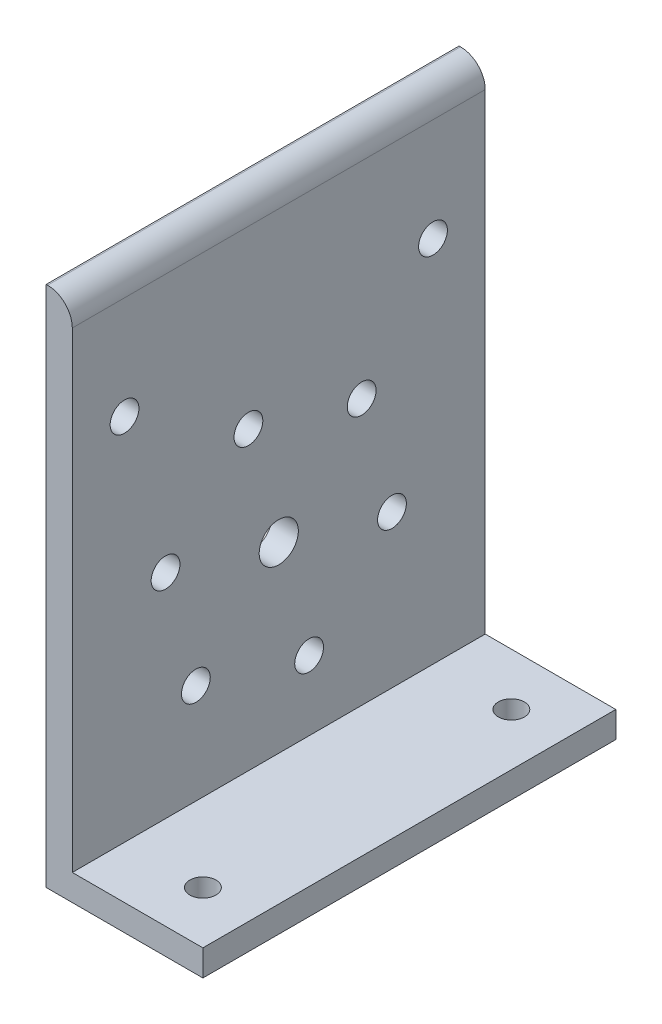
ISO-10303-21;
HEADER;
FILE_DESCRIPTION(('STEP AP214'),'2;1');
FILE_NAME('part.step','',(''),(''),'','','');
FILE_SCHEMA(('AUTOMOTIVE_DESIGN { 1 0 10303 214 1 1 1 1 }'));
ENDSEC;
DATA;
#1=APPLICATION_CONTEXT('core data for automotive mechanical design processes');
#2=APPLICATION_PROTOCOL_DEFINITION('international standard','automotive_design',2000,#1);
#3=PRODUCT_CONTEXT('',#1,'mechanical');
#4=PRODUCT('Part','Part','',(#3));
#5=PRODUCT_RELATED_PRODUCT_CATEGORY('part','',(#4));
#6=PRODUCT_DEFINITION_FORMATION('','',#4);
#7=PRODUCT_DEFINITION_CONTEXT('part definition',#1,'design');
#8=PRODUCT_DEFINITION('design','',#6,#7);
#9=PRODUCT_DEFINITION_SHAPE('','',#8);
#10=(LENGTH_UNIT() NAMED_UNIT(*) SI_UNIT(.MILLI.,.METRE.));
#11=(NAMED_UNIT(*) PLANE_ANGLE_UNIT() SI_UNIT($,.RADIAN.));
#12=(NAMED_UNIT(*) SI_UNIT($,.STERADIAN.) SOLID_ANGLE_UNIT());
#13=UNCERTAINTY_MEASURE_WITH_UNIT(LENGTH_MEASURE(1.E-05),#10,'distance_accuracy_value','');
#14=(GEOMETRIC_REPRESENTATION_CONTEXT(3) GLOBAL_UNCERTAINTY_ASSIGNED_CONTEXT((#13)) GLOBAL_UNIT_ASSIGNED_CONTEXT((#10,
#11,#12)) REPRESENTATION_CONTEXT('',''));
#15=CARTESIAN_POINT('',(0.,0.,0.));
#16=DIRECTION('',(0.,0.,1.));
#17=DIRECTION('',(1.,0.,0.));
#18=AXIS2_PLACEMENT_3D('',#15,#16,#17);
#19=CARTESIAN_POINT('',(0.35,121.,100.4));
#20=DIRECTION('',(0.,0.,-1.));
#21=DIRECTION('',(-1.,0.,0.));
#22=AXIS2_PLACEMENT_3D('',#19,#20,#21);
#23=CYLINDRICAL_SURFACE('',#22,6.);
#24=CARTESIAN_POINT('',(0.35,121.,0.));
#25=DIRECTION('',(0.,0.,1.));
#26=DIRECTION('',(1.,0.,0.));
#27=AXIS2_PLACEMENT_3D('',#24,#25,#26);
#28=CIRCLE('',#27,6.);
#29=CARTESIAN_POINT('',(0.35,127.,0.));
#30=VERTEX_POINT('',#29);
#31=CARTESIAN_POINT('',(6.35,121.,0.));
#32=VERTEX_POINT('',#31);
#33=EDGE_CURVE('E127',#30,#32,#28,.F.);
#34=ORIENTED_EDGE('',*,*,#33,.F.);
#35=DIRECTION('',(0.,0.,-1.));
#36=VECTOR('',#35,1.);
#37=CARTESIAN_POINT('',(0.35,127.,100.4));
#38=LINE('',#37,#36);
#39=CARTESIAN_POINT('',(0.35,127.,100.4));
#40=VERTEX_POINT('',#39);
#41=EDGE_CURVE('E11',#40,#30,#38,.T.);
#42=ORIENTED_EDGE('',*,*,#41,.F.);
#43=CARTESIAN_POINT('',(0.35,121.,100.4));
#44=DIRECTION('',(0.,0.,1.));
#45=DIRECTION('',(1.,0.,0.));
#46=AXIS2_PLACEMENT_3D('',#43,#44,#45);
#47=CIRCLE('',#46,6.);
#48=CARTESIAN_POINT('',(6.35,121.,100.4));
#49=VERTEX_POINT('',#48);
#50=EDGE_CURVE('E145',#40,#49,#47,.F.);
#51=ORIENTED_EDGE('',*,*,#50,.T.);
#52=DIRECTION('',(0.,0.,-1.));
#53=VECTOR('',#52,1.);
#54=CARTESIAN_POINT('',(6.35,121.,100.4));
#55=LINE('',#54,#53);
#56=EDGE_CURVE('E87',#49,#32,#55,.T.);
#57=ORIENTED_EDGE('',*,*,#56,.T.);
#58=EDGE_LOOP('',(#34,#42,#51,#57));
#59=FACE_BOUND('',#58,.T.);
#60=ADVANCED_FACE('F38',(#59),#23,.T.);
#61=CARTESIAN_POINT('',(0.,127.,100.4));
#62=DIRECTION('',(0.,1.,0.));
#63=DIRECTION('',(0.,0.,1.));
#64=AXIS2_PLACEMENT_3D('',#61,#62,#63);
#65=PLANE('',#64);
#66=DIRECTION('',(1.,0.,0.));
#67=VECTOR('',#66,1.);
#68=CARTESIAN_POINT('',(0.,127.,0.));
#69=LINE('',#68,#67);
#70=CARTESIAN_POINT('',(0.,127.,0.));
#71=VERTEX_POINT('',#70);
#72=EDGE_CURVE('E130',#71,#30,#69,.T.);
#73=ORIENTED_EDGE('',*,*,#72,.F.);
#74=DIRECTION('',(0.,0.,-1.));
#75=VECTOR('',#74,1.);
#76=CARTESIAN_POINT('',(0.,127.,100.4));
#77=LINE('',#76,#75);
#78=CARTESIAN_POINT('',(0.,127.,100.4));
#79=VERTEX_POINT('',#78);
#80=EDGE_CURVE('E47',#79,#71,#77,.T.);
#81=ORIENTED_EDGE('',*,*,#80,.F.);
#82=DIRECTION('',(1.,0.,0.));
#83=VECTOR('',#82,1.);
#84=CARTESIAN_POINT('',(0.,127.,100.4));
#85=LINE('',#84,#83);
#86=EDGE_CURVE('E189',#79,#40,#85,.T.);
#87=ORIENTED_EDGE('',*,*,#86,.T.);
#88=ORIENTED_EDGE('',*,*,#41,.T.);
#89=EDGE_LOOP('',(#73,#81,#87,#88));
#90=FACE_BOUND('',#89,.T.);
#91=ADVANCED_FACE('F204',(#90),#65,.T.);
#92=CARTESIAN_POINT('',(0.,0.,100.4));
#93=DIRECTION('',(-1.,0.,0.));
#94=DIRECTION('',(0.,0.,1.));
#95=AXIS2_PLACEMENT_3D('',#92,#93,#94);
#96=PLANE('',#95);
#97=CARTESIAN_POINT('',(0.,96.,87.7));
#98=DIRECTION('',(-1.,0.,0.));
#99=DIRECTION('',(0.,0.,1.));
#100=AXIS2_PLACEMENT_3D('',#97,#98,#99);
#101=CIRCLE('',#100,3.50000000000001);
#102=CARTESIAN_POINT('',(0.,96.,91.2));
#103=VERTEX_POINT('',#102);
#104=EDGE_CURVE('E396',#103,#103,#101,.T.);
#105=ORIENTED_EDGE('',*,*,#104,.F.);
#106=EDGE_LOOP('',(#105));
#107=FACE_BOUND('',#106,.T.);
#108=CARTESIAN_POINT('',(0.,96.,12.7));
#109=DIRECTION('',(-1.,0.,0.));
#110=DIRECTION('',(0.,0.,1.));
#111=AXIS2_PLACEMENT_3D('',#108,#109,#110);
#112=CIRCLE('',#111,3.50000000000001);
#113=CARTESIAN_POINT('',(0.,96.,16.2));
#114=VERTEX_POINT('',#113);
#115=EDGE_CURVE('E400',#114,#114,#112,.T.);
#116=ORIENTED_EDGE('',*,*,#115,.F.);
#117=EDGE_LOOP('',(#116));
#118=FACE_BOUND('',#117,.T.);
#119=CARTESIAN_POINT('',(0.,30.6474567361834,70.352543263818));
#120=DIRECTION('',(-1.,0.,0.));
#121=DIRECTION('',(0.,0.,1.));
#122=AXIS2_PLACEMENT_3D('',#119,#120,#121);
#123=CIRCLE('',#122,3.50000000000001);
#124=CARTESIAN_POINT('',(0.,30.6474567361834,73.852543263818));
#125=VERTEX_POINT('',#124);
#126=EDGE_CURVE('E131',#125,#125,#123,.T.);
#127=ORIENTED_EDGE('',*,*,#126,.F.);
#128=EDGE_LOOP('',(#127));
#129=FACE_BOUND('',#128,.T.);
#130=CARTESIAN_POINT('',(0.,70.9525432638158,30.0474567361834));
#131=DIRECTION('',(-1.,0.,0.));
#132=DIRECTION('',(0.,0.,1.));
#133=AXIS2_PLACEMENT_3D('',#130,#131,#132);
#134=CIRCLE('',#133,3.5);
#135=CARTESIAN_POINT('',(0.,70.9525432638158,33.5474567361834));
#136=VERTEX_POINT('',#135);
#137=EDGE_CURVE('E174',#136,#136,#134,.T.);
#138=ORIENTED_EDGE('',*,*,#137,.F.);
#139=EDGE_LOOP('',(#138));
#140=FACE_BOUND('',#139,.T.);
#141=CARTESIAN_POINT('',(0.,58.1763427854222,77.7288860492391));
#142=DIRECTION('',(-1.,0.,0.));
#143=DIRECTION('',(0.,0.,1.));
#144=AXIS2_PLACEMENT_3D('',#141,#142,#143);
#145=CIRCLE('',#144,3.50000000000001);
#146=CARTESIAN_POINT('',(0.,58.1763427854222,81.2288860492391));
#147=VERTEX_POINT('',#146);
#148=EDGE_CURVE('E171',#147,#147,#145,.T.);
#149=ORIENTED_EDGE('',*,*,#148,.F.);
#150=EDGE_LOOP('',(#149));
#151=FACE_BOUND('',#150,.T.);
#152=CARTESIAN_POINT('',(0.,78.3288860492384,57.5763427854219));
#153=DIRECTION('',(-1.,0.,0.));
#154=DIRECTION('',(0.,0.,1.));
#155=AXIS2_PLACEMENT_3D('',#152,#153,#154);
#156=CIRCLE('',#155,3.5);
#157=CARTESIAN_POINT('',(0.,78.3288860492384,61.0763427854219));
#158=VERTEX_POINT('',#157);
#159=EDGE_CURVE('E168',#158,#158,#156,.T.);
#160=ORIENTED_EDGE('',*,*,#159,.F.);
#161=EDGE_LOOP('',(#160));
#162=FACE_BOUND('',#161,.T.);
#163=CARTESIAN_POINT('',(0.,23.2711139507607,42.8236572145795));
#164=DIRECTION('',(-1.,0.,0.));
#165=DIRECTION('',(0.,0.,1.));
#166=AXIS2_PLACEMENT_3D('',#163,#164,#165);
#167=CIRCLE('',#166,3.5);
#168=CARTESIAN_POINT('',(0.,23.2711139507607,46.3236572145795));
#169=VERTEX_POINT('',#168);
#170=EDGE_CURVE('E164',#169,#169,#167,.T.);
#171=ORIENTED_EDGE('',*,*,#170,.F.);
#172=EDGE_LOOP('',(#171));
#173=FACE_BOUND('',#172,.T.);
#174=CARTESIAN_POINT('',(0.,43.4236572145769,22.6711139507622));
#175=DIRECTION('',(-1.,0.,0.));
#176=DIRECTION('',(0.,0.,1.));
#177=AXIS2_PLACEMENT_3D('',#174,#175,#176);
#178=CIRCLE('',#177,3.5);
#179=CARTESIAN_POINT('',(0.,43.4236572145769,26.1711139507622));
#180=VERTEX_POINT('',#179);
#181=EDGE_CURVE('E160',#180,#180,#178,.T.);
#182=ORIENTED_EDGE('',*,*,#181,.F.);
#183=EDGE_LOOP('',(#182));
#184=FACE_BOUND('',#183,.T.);
#185=CARTESIAN_POINT('',(0.,50.8,50.2));
#186=DIRECTION('',(-1.,0.,0.));
#187=DIRECTION('',(0.,0.,1.));
#188=AXIS2_PLACEMENT_3D('',#185,#186,#187);
#189=CIRCLE('',#188,4.7625);
#190=CARTESIAN_POINT('',(0.,50.8,54.9625));
#191=VERTEX_POINT('',#190);
#192=EDGE_CURVE('E155',#191,#191,#189,.T.);
#193=ORIENTED_EDGE('',*,*,#192,.F.);
#194=EDGE_LOOP('',(#193));
#195=FACE_BOUND('',#194,.T.);
#196=DIRECTION('',(0.,1.,0.));
#197=VECTOR('',#196,1.);
#198=CARTESIAN_POINT('',(0.,0.,0.));
#199=LINE('',#198,#197);
#200=CARTESIAN_POINT('',(0.,0.,0.));
#201=VERTEX_POINT('',#200);
#202=EDGE_CURVE('E134',#201,#71,#199,.T.);
#203=ORIENTED_EDGE('',*,*,#202,.F.);
#204=DIRECTION('',(0.,0.,-1.));
#205=VECTOR('',#204,1.);
#206=CARTESIAN_POINT('',(0.,0.,100.4));
#207=LINE('',#206,#205);
#208=CARTESIAN_POINT('',(0.,0.,100.4));
#209=VERTEX_POINT('',#208);
#210=EDGE_CURVE('E149',#209,#201,#207,.T.);
#211=ORIENTED_EDGE('',*,*,#210,.F.);
#212=DIRECTION('',(0.,1.,0.));
#213=VECTOR('',#212,1.);
#214=CARTESIAN_POINT('',(0.,0.,100.4));
#215=LINE('',#214,#213);
#216=EDGE_CURVE('E192',#209,#79,#215,.T.);
#217=ORIENTED_EDGE('',*,*,#216,.T.);
#218=ORIENTED_EDGE('',*,*,#80,.T.);
#219=EDGE_LOOP('',(#203,#211,#217,#218));
#220=FACE_BOUND('',#219,.T.);
#221=ADVANCED_FACE('F206',(#107,#118,#129,#140,#151,#162,#173,#184,#195,#220),#96,.T.);
#222=CARTESIAN_POINT('',(0.,0.,100.4));
#223=DIRECTION('',(0.,-1.,0.));
#224=DIRECTION('',(0.,0.,-1.));
#225=AXIS2_PLACEMENT_3D('',#222,#223,#224);
#226=PLANE('',#225);
#227=CARTESIAN_POINT('',(25.4,0.,12.7));
#228=DIRECTION('',(0.,1.,0.));
#229=DIRECTION('',(0.,0.,1.));
#230=AXIS2_PLACEMENT_3D('',#227,#228,#229);
#231=CIRCLE('',#230,3.17500000000001);
#232=CARTESIAN_POINT('',(25.4,0.,15.875));
#233=VERTEX_POINT('',#232);
#234=EDGE_CURVE('E156',#233,#233,#231,.T.);
#235=ORIENTED_EDGE('',*,*,#234,.T.);
#236=EDGE_LOOP('',(#235));
#237=FACE_BOUND('',#236,.T.);
#238=CARTESIAN_POINT('',(25.4,0.,87.7));
#239=DIRECTION('',(0.,1.,0.));
#240=DIRECTION('',(0.,0.,1.));
#241=AXIS2_PLACEMENT_3D('',#238,#239,#240);
#242=CIRCLE('',#241,3.175);
#243=CARTESIAN_POINT('',(25.4,0.,90.875));
#244=VERTEX_POINT('',#243);
#245=EDGE_CURVE('E415',#244,#244,#242,.T.);
#246=ORIENTED_EDGE('',*,*,#245,.T.);
#247=EDGE_LOOP('',(#246));
#248=FACE_BOUND('',#247,.T.);
#249=DIRECTION('',(-1.,0.,0.));
#250=VECTOR('',#249,1.);
#251=CARTESIAN_POINT('',(0.,0.,0.));
#252=LINE('',#251,#250);
#253=CARTESIAN_POINT('',(38.1,0.,0.));
#254=VERTEX_POINT('',#253);
#255=EDGE_CURVE('E137',#254,#201,#252,.T.);
#256=ORIENTED_EDGE('',*,*,#255,.F.);
#257=DIRECTION('',(0.,0.,-1.));
#258=VECTOR('',#257,1.);
#259=CARTESIAN_POINT('',(38.1,0.,100.4));
#260=LINE('',#259,#258);
#261=CARTESIAN_POINT('',(38.1,0.,100.4));
#262=VERTEX_POINT('',#261);
#263=EDGE_CURVE('E120',#262,#254,#260,.T.);
#264=ORIENTED_EDGE('',*,*,#263,.F.);
#265=DIRECTION('',(-1.,0.,0.));
#266=VECTOR('',#265,1.);
#267=CARTESIAN_POINT('',(0.,0.,100.4));
#268=LINE('',#267,#266);
#269=EDGE_CURVE('E109',#262,#209,#268,.T.);
#270=ORIENTED_EDGE('',*,*,#269,.T.);
#271=ORIENTED_EDGE('',*,*,#210,.T.);
#272=EDGE_LOOP('',(#256,#264,#270,#271));
#273=FACE_BOUND('',#272,.T.);
#274=ADVANCED_FACE('F196',(#237,#248,#273),#226,.T.);
#275=CARTESIAN_POINT('',(38.1,0.,100.4));
#276=DIRECTION('',(-1.,0.,0.));
#277=DIRECTION('',(0.,0.,1.));
#278=AXIS2_PLACEMENT_3D('',#275,#276,#277);
#279=PLANE('',#278);
#280=DIRECTION('',(0.,1.,0.));
#281=VECTOR('',#280,1.);
#282=CARTESIAN_POINT('',(38.1,0.,0.));
#283=LINE('',#282,#281);
#284=CARTESIAN_POINT('',(38.1,6.35,0.));
#285=VERTEX_POINT('',#284);
#286=EDGE_CURVE('E116',#254,#285,#283,.T.);
#287=ORIENTED_EDGE('',*,*,#286,.T.);
#288=DIRECTION('',(0.,0.,-1.));
#289=VECTOR('',#288,1.);
#290=CARTESIAN_POINT('',(38.1,6.35,100.4));
#291=LINE('',#290,#289);
#292=CARTESIAN_POINT('',(38.1,6.35,100.4));
#293=VERTEX_POINT('',#292);
#294=EDGE_CURVE('E113',#293,#285,#291,.T.);
#295=ORIENTED_EDGE('',*,*,#294,.F.);
#296=DIRECTION('',(0.,1.,0.));
#297=VECTOR('',#296,1.);
#298=CARTESIAN_POINT('',(38.1,0.,100.4));
#299=LINE('',#298,#297);
#300=EDGE_CURVE('E102',#262,#293,#299,.T.);
#301=ORIENTED_EDGE('',*,*,#300,.F.);
#302=ORIENTED_EDGE('',*,*,#263,.T.);
#303=EDGE_LOOP('',(#287,#295,#301,#302));
#304=FACE_BOUND('',#303,.T.);
#305=ADVANCED_FACE('F114',(#304),#279,.F.);
#306=CARTESIAN_POINT('',(0.,6.35,100.4));
#307=DIRECTION('',(0.,1.,0.));
#308=DIRECTION('',(0.,0.,1.));
#309=AXIS2_PLACEMENT_3D('',#306,#307,#308);
#310=PLANE('',#309);
#311=CARTESIAN_POINT('',(25.4,6.35,12.7));
#312=DIRECTION('',(0.,1.,0.));
#313=DIRECTION('',(0.,0.,1.));
#314=AXIS2_PLACEMENT_3D('',#311,#312,#313);
#315=CIRCLE('',#314,3.17500000000001);
#316=CARTESIAN_POINT('',(25.4,6.35,15.875));
#317=VERTEX_POINT('',#316);
#318=EDGE_CURVE('E412',#317,#317,#315,.T.);
#319=ORIENTED_EDGE('',*,*,#318,.F.);
#320=EDGE_LOOP('',(#319));
#321=FACE_BOUND('',#320,.T.);
#322=CARTESIAN_POINT('',(25.4,6.35,87.7));
#323=DIRECTION('',(0.,1.,0.));
#324=DIRECTION('',(0.,0.,1.));
#325=AXIS2_PLACEMENT_3D('',#322,#323,#324);
#326=CIRCLE('',#325,3.175);
#327=CARTESIAN_POINT('',(25.4,6.35,90.875));
#328=VERTEX_POINT('',#327);
#329=EDGE_CURVE('E409',#328,#328,#326,.T.);
#330=ORIENTED_EDGE('',*,*,#329,.F.);
#331=EDGE_LOOP('',(#330));
#332=FACE_BOUND('',#331,.T.);
#333=DIRECTION('',(1.,0.,0.));
#334=VECTOR('',#333,1.);
#335=CARTESIAN_POINT('',(0.,6.35,0.));
#336=LINE('',#335,#334);
#337=CARTESIAN_POINT('',(6.35,6.35,0.));
#338=VERTEX_POINT('',#337);
#339=EDGE_CURVE('E141',#338,#285,#336,.T.);
#340=ORIENTED_EDGE('',*,*,#339,.F.);
#341=DIRECTION('',(0.,0.,-1.));
#342=VECTOR('',#341,1.);
#343=CARTESIAN_POINT('',(6.35,6.35,100.4));
#344=LINE('',#343,#342);
#345=CARTESIAN_POINT('',(6.35,6.35,100.4));
#346=VERTEX_POINT('',#345);
#347=EDGE_CURVE('E80',#346,#338,#344,.T.);
#348=ORIENTED_EDGE('',*,*,#347,.F.);
#349=DIRECTION('',(1.,0.,0.));
#350=VECTOR('',#349,1.);
#351=CARTESIAN_POINT('',(0.,6.35,100.4));
#352=LINE('',#351,#350);
#353=EDGE_CURVE('E106',#346,#293,#352,.T.);
#354=ORIENTED_EDGE('',*,*,#353,.T.);
#355=ORIENTED_EDGE('',*,*,#294,.T.);
#356=EDGE_LOOP('',(#340,#348,#354,#355));
#357=FACE_BOUND('',#356,.T.);
#358=ADVANCED_FACE('F122',(#321,#332,#357),#310,.T.);
#359=CARTESIAN_POINT('',(6.35,0.,100.4));
#360=DIRECTION('',(-1.,0.,0.));
#361=DIRECTION('',(0.,-1.,0.));
#362=AXIS2_PLACEMENT_3D('',#359,#360,#361);
#363=PLANE('',#362);
#364=CARTESIAN_POINT('',(6.35,96.,87.7));
#365=DIRECTION('',(1.,0.,0.));
#366=DIRECTION('',(0.,0.,-1.));
#367=AXIS2_PLACEMENT_3D('',#364,#365,#366);
#368=CIRCLE('',#367,3.50000000000001);
#369=CARTESIAN_POINT('',(6.35,96.,84.2));
#370=VERTEX_POINT('',#369);
#371=EDGE_CURVE('E399',#370,#370,#368,.T.);
#372=ORIENTED_EDGE('',*,*,#371,.F.);
#373=EDGE_LOOP('',(#372));
#374=FACE_BOUND('',#373,.T.);
#375=CARTESIAN_POINT('',(6.35,96.,12.7));
#376=DIRECTION('',(1.,0.,0.));
#377=DIRECTION('',(0.,0.,1.));
#378=AXIS2_PLACEMENT_3D('',#375,#376,#377);
#379=CIRCLE('',#378,3.50000000000001);
#380=CARTESIAN_POINT('',(6.35,96.,16.2));
#381=VERTEX_POINT('',#380);
#382=EDGE_CURVE('E401',#381,#381,#379,.T.);
#383=ORIENTED_EDGE('',*,*,#382,.F.);
#384=EDGE_LOOP('',(#383));
#385=FACE_BOUND('',#384,.T.);
#386=CARTESIAN_POINT('',(6.35,30.6474567361834,70.352543263818));
#387=DIRECTION('',(-1.,0.,0.));
#388=DIRECTION('',(0.,-1.,0.));
#389=AXIS2_PLACEMENT_3D('',#386,#387,#388);
#390=CIRCLE('',#389,3.50000000000001);
#391=CARTESIAN_POINT('',(6.35,27.1474567361834,70.352543263818));
#392=VERTEX_POINT('',#391);
#393=EDGE_CURVE('E41',#392,#392,#390,.T.);
#394=ORIENTED_EDGE('',*,*,#393,.T.);
#395=EDGE_LOOP('',(#394));
#396=FACE_BOUND('',#395,.T.);
#397=CARTESIAN_POINT('',(6.35,70.9525432638158,30.0474567361834));
#398=DIRECTION('',(-1.,0.,0.));
#399=DIRECTION('',(0.,-1.,0.));
#400=AXIS2_PLACEMENT_3D('',#397,#398,#399);
#401=CIRCLE('',#400,3.5);
#402=CARTESIAN_POINT('',(6.35,67.4525432638158,30.0474567361834));
#403=VERTEX_POINT('',#402);
#404=EDGE_CURVE('E172',#403,#403,#401,.T.);
#405=ORIENTED_EDGE('',*,*,#404,.T.);
#406=EDGE_LOOP('',(#405));
#407=FACE_BOUND('',#406,.T.);
#408=CARTESIAN_POINT('',(6.35,58.1763427854222,77.7288860492391));
#409=DIRECTION('',(-1.,0.,0.));
#410=DIRECTION('',(0.,-1.,0.));
#411=AXIS2_PLACEMENT_3D('',#408,#409,#410);
#412=CIRCLE('',#411,3.50000000000001);
#413=CARTESIAN_POINT('',(6.35,54.6763427854222,77.7288860492391));
#414=VERTEX_POINT('',#413);
#415=EDGE_CURVE('E169',#414,#414,#412,.T.);
#416=ORIENTED_EDGE('',*,*,#415,.T.);
#417=EDGE_LOOP('',(#416));
#418=FACE_BOUND('',#417,.T.);
#419=CARTESIAN_POINT('',(6.35,78.3288860492384,57.5763427854219));
#420=DIRECTION('',(-1.,0.,0.));
#421=DIRECTION('',(0.,-1.,0.));
#422=AXIS2_PLACEMENT_3D('',#419,#420,#421);
#423=CIRCLE('',#422,3.5);
#424=CARTESIAN_POINT('',(6.35,74.8288860492384,57.5763427854219));
#425=VERTEX_POINT('',#424);
#426=EDGE_CURVE('E165',#425,#425,#423,.T.);
#427=ORIENTED_EDGE('',*,*,#426,.T.);
#428=EDGE_LOOP('',(#427));
#429=FACE_BOUND('',#428,.T.);
#430=CARTESIAN_POINT('',(6.35,23.2711139507607,42.8236572145795));
#431=DIRECTION('',(-1.,0.,0.));
#432=DIRECTION('',(0.,-1.,0.));
#433=AXIS2_PLACEMENT_3D('',#430,#431,#432);
#434=CIRCLE('',#433,3.5);
#435=CARTESIAN_POINT('',(6.35,19.7711139507607,42.8236572145795));
#436=VERTEX_POINT('',#435);
#437=EDGE_CURVE('E161',#436,#436,#434,.T.);
#438=ORIENTED_EDGE('',*,*,#437,.T.);
#439=EDGE_LOOP('',(#438));
#440=FACE_BOUND('',#439,.T.);
#441=CARTESIAN_POINT('',(6.35,43.4236572145769,22.6711139507622));
#442=DIRECTION('',(-1.,0.,0.));
#443=DIRECTION('',(0.,-1.,0.));
#444=AXIS2_PLACEMENT_3D('',#441,#442,#443);
#445=CIRCLE('',#444,3.5);
#446=CARTESIAN_POINT('',(6.35,39.9236572145769,22.6711139507622));
#447=VERTEX_POINT('',#446);
#448=EDGE_CURVE('E157',#447,#447,#445,.T.);
#449=ORIENTED_EDGE('',*,*,#448,.T.);
#450=EDGE_LOOP('',(#449));
#451=FACE_BOUND('',#450,.T.);
#452=CARTESIAN_POINT('',(6.35,50.8,50.2));
#453=DIRECTION('',(-1.,0.,0.));
#454=DIRECTION('',(0.,-1.,0.));
#455=AXIS2_PLACEMENT_3D('',#452,#453,#454);
#456=CIRCLE('',#455,4.7625);
#457=CARTESIAN_POINT('',(6.35,46.0375,50.2));
#458=VERTEX_POINT('',#457);
#459=EDGE_CURVE('E152',#458,#458,#456,.T.);
#460=ORIENTED_EDGE('',*,*,#459,.T.);
#461=EDGE_LOOP('',(#460));
#462=FACE_BOUND('',#461,.T.);
#463=DIRECTION('',(0.,1.,0.));
#464=VECTOR('',#463,1.);
#465=CARTESIAN_POINT('',(6.35,0.,0.));
#466=LINE('',#465,#464);
#467=EDGE_CURVE('E143',#338,#32,#466,.T.);
#468=ORIENTED_EDGE('',*,*,#467,.T.);
#469=ORIENTED_EDGE('',*,*,#56,.F.);
#470=DIRECTION('',(0.,1.,0.));
#471=VECTOR('',#470,1.);
#472=CARTESIAN_POINT('',(6.35,0.,100.4));
#473=LINE('',#472,#471);
#474=EDGE_CURVE('E56',#346,#49,#473,.T.);
#475=ORIENTED_EDGE('',*,*,#474,.F.);
#476=ORIENTED_EDGE('',*,*,#347,.T.);
#477=EDGE_LOOP('',(#468,#469,#475,#476));
#478=FACE_BOUND('',#477,.T.);
#479=ADVANCED_FACE('F200',(#374,#385,#396,#407,#418,#429,#440,#451,#462,#478),#363,.F.);
#480=CARTESIAN_POINT('',(0.,0.,100.4));
#481=DIRECTION('',(0.,0.,1.));
#482=DIRECTION('',(1.,0.,0.));
#483=AXIS2_PLACEMENT_3D('',#480,#481,#482);
#484=PLANE('',#483);
#485=ORIENTED_EDGE('',*,*,#50,.F.);
#486=ORIENTED_EDGE('',*,*,#86,.F.);
#487=ORIENTED_EDGE('',*,*,#216,.F.);
#488=ORIENTED_EDGE('',*,*,#269,.F.);
#489=ORIENTED_EDGE('',*,*,#300,.T.);
#490=ORIENTED_EDGE('',*,*,#353,.F.);
#491=ORIENTED_EDGE('',*,*,#474,.T.);
#492=EDGE_LOOP('',(#485,#486,#487,#488,#489,#490,#491));
#493=FACE_BOUND('',#492,.T.);
#494=ADVANCED_FACE('F104',(#493),#484,.T.);
#495=CARTESIAN_POINT('',(0.,0.,0.));
#496=DIRECTION('',(0.,0.,1.));
#497=DIRECTION('',(1.,0.,0.));
#498=AXIS2_PLACEMENT_3D('',#495,#496,#497);
#499=PLANE('',#498);
#500=ORIENTED_EDGE('',*,*,#33,.T.);
#501=ORIENTED_EDGE('',*,*,#467,.F.);
#502=ORIENTED_EDGE('',*,*,#339,.T.);
#503=ORIENTED_EDGE('',*,*,#286,.F.);
#504=ORIENTED_EDGE('',*,*,#255,.T.);
#505=ORIENTED_EDGE('',*,*,#202,.T.);
#506=ORIENTED_EDGE('',*,*,#72,.T.);
#507=EDGE_LOOP('',(#500,#501,#502,#503,#504,#505,#506));
#508=FACE_BOUND('',#507,.T.);
#509=ADVANCED_FACE('F199',(#508),#499,.F.);
#510=CARTESIAN_POINT('',(38.1,50.8,50.2));
#511=DIRECTION('',(-1.,0.,0.));
#512=DIRECTION('',(0.,0.,1.));
#513=AXIS2_PLACEMENT_3D('',#510,#511,#512);
#514=CYLINDRICAL_SURFACE('',#513,4.7625);
#515=ORIENTED_EDGE('',*,*,#192,.T.);
#516=EDGE_LOOP('',(#515));
#517=FACE_BOUND('',#516,.T.);
#518=ORIENTED_EDGE('',*,*,#459,.F.);
#519=EDGE_LOOP('',(#518));
#520=FACE_BOUND('',#519,.T.);
#521=ADVANCED_FACE('F256',(#517,#520),#514,.F.);
#522=CARTESIAN_POINT('',(38.1,43.4236572145769,22.6711139507622));
#523=DIRECTION('',(-1.,0.,0.));
#524=DIRECTION('',(0.,0.,1.));
#525=AXIS2_PLACEMENT_3D('',#522,#523,#524);
#526=CYLINDRICAL_SURFACE('',#525,3.5);
#527=ORIENTED_EDGE('',*,*,#181,.T.);
#528=EDGE_LOOP('',(#527));
#529=FACE_BOUND('',#528,.T.);
#530=ORIENTED_EDGE('',*,*,#448,.F.);
#531=EDGE_LOOP('',(#530));
#532=FACE_BOUND('',#531,.T.);
#533=ADVANCED_FACE('F265',(#529,#532),#526,.F.);
#534=CARTESIAN_POINT('',(38.1,23.2711139507607,42.8236572145795));
#535=DIRECTION('',(-1.,0.,0.));
#536=DIRECTION('',(0.,0.,1.));
#537=AXIS2_PLACEMENT_3D('',#534,#535,#536);
#538=CYLINDRICAL_SURFACE('',#537,3.5);
#539=ORIENTED_EDGE('',*,*,#170,.T.);
#540=EDGE_LOOP('',(#539));
#541=FACE_BOUND('',#540,.T.);
#542=ORIENTED_EDGE('',*,*,#437,.F.);
#543=EDGE_LOOP('',(#542));
#544=FACE_BOUND('',#543,.T.);
#545=ADVANCED_FACE('F275',(#541,#544),#538,.F.);
#546=CARTESIAN_POINT('',(38.1,78.3288860492384,57.5763427854219));
#547=DIRECTION('',(-1.,0.,0.));
#548=DIRECTION('',(0.,0.,1.));
#549=AXIS2_PLACEMENT_3D('',#546,#547,#548);
#550=CYLINDRICAL_SURFACE('',#549,3.5);
#551=ORIENTED_EDGE('',*,*,#159,.T.);
#552=EDGE_LOOP('',(#551));
#553=FACE_BOUND('',#552,.T.);
#554=ORIENTED_EDGE('',*,*,#426,.F.);
#555=EDGE_LOOP('',(#554));
#556=FACE_BOUND('',#555,.T.);
#557=ADVANCED_FACE('F285',(#553,#556),#550,.F.);
#558=CARTESIAN_POINT('',(38.1,58.1763427854222,77.7288860492391));
#559=DIRECTION('',(-1.,0.,0.));
#560=DIRECTION('',(0.,0.,1.));
#561=AXIS2_PLACEMENT_3D('',#558,#559,#560);
#562=CYLINDRICAL_SURFACE('',#561,3.50000000000001);
#563=ORIENTED_EDGE('',*,*,#148,.T.);
#564=EDGE_LOOP('',(#563));
#565=FACE_BOUND('',#564,.T.);
#566=ORIENTED_EDGE('',*,*,#415,.F.);
#567=EDGE_LOOP('',(#566));
#568=FACE_BOUND('',#567,.T.);
#569=ADVANCED_FACE('F295',(#565,#568),#562,.F.);
#570=CARTESIAN_POINT('',(38.1,70.9525432638158,30.0474567361834));
#571=DIRECTION('',(-1.,0.,0.));
#572=DIRECTION('',(0.,0.,1.));
#573=AXIS2_PLACEMENT_3D('',#570,#571,#572);
#574=CYLINDRICAL_SURFACE('',#573,3.5);
#575=ORIENTED_EDGE('',*,*,#137,.T.);
#576=EDGE_LOOP('',(#575));
#577=FACE_BOUND('',#576,.T.);
#578=ORIENTED_EDGE('',*,*,#404,.F.);
#579=EDGE_LOOP('',(#578));
#580=FACE_BOUND('',#579,.T.);
#581=ADVANCED_FACE('F305',(#577,#580),#574,.F.);
#582=CARTESIAN_POINT('',(38.1,30.6474567361834,70.352543263818));
#583=DIRECTION('',(-1.,0.,0.));
#584=DIRECTION('',(0.,0.,1.));
#585=AXIS2_PLACEMENT_3D('',#582,#583,#584);
#586=CYLINDRICAL_SURFACE('',#585,3.50000000000001);
#587=ORIENTED_EDGE('',*,*,#126,.T.);
#588=EDGE_LOOP('',(#587));
#589=FACE_BOUND('',#588,.T.);
#590=ORIENTED_EDGE('',*,*,#393,.F.);
#591=EDGE_LOOP('',(#590));
#592=FACE_BOUND('',#591,.T.);
#593=ADVANCED_FACE('F314',(#589,#592),#586,.F.);
#594=CARTESIAN_POINT('',(25.4,0.,87.7));
#595=DIRECTION('',(0.,1.,0.));
#596=DIRECTION('',(0.,0.,1.));
#597=AXIS2_PLACEMENT_3D('',#594,#595,#596);
#598=CYLINDRICAL_SURFACE('',#597,3.175);
#599=ORIENTED_EDGE('',*,*,#245,.F.);
#600=EDGE_LOOP('',(#599));
#601=FACE_BOUND('',#600,.T.);
#602=ORIENTED_EDGE('',*,*,#329,.T.);
#603=EDGE_LOOP('',(#602));
#604=FACE_BOUND('',#603,.T.);
#605=ADVANCED_FACE('F324',(#601,#604),#598,.F.);
#606=CARTESIAN_POINT('',(25.4,0.,12.7));
#607=DIRECTION('',(0.,1.,0.));
#608=DIRECTION('',(0.,0.,1.));
#609=AXIS2_PLACEMENT_3D('',#606,#607,#608);
#610=CYLINDRICAL_SURFACE('',#609,3.17500000000001);
#611=ORIENTED_EDGE('',*,*,#234,.F.);
#612=EDGE_LOOP('',(#611));
#613=FACE_BOUND('',#612,.T.);
#614=ORIENTED_EDGE('',*,*,#318,.T.);
#615=EDGE_LOOP('',(#614));
#616=FACE_BOUND('',#615,.T.);
#617=ADVANCED_FACE('F350',(#613,#616),#610,.F.);
#618=CARTESIAN_POINT('',(-3.65,96.,12.7));
#619=DIRECTION('',(1.,0.,0.));
#620=DIRECTION('',(0.,0.,-1.));
#621=AXIS2_PLACEMENT_3D('',#618,#619,#620);
#622=CYLINDRICAL_SURFACE('',#621,3.50000000000001);
#623=ORIENTED_EDGE('',*,*,#115,.T.);
#624=EDGE_LOOP('',(#623));
#625=FACE_BOUND('',#624,.T.);
#626=ORIENTED_EDGE('',*,*,#382,.T.);
#627=EDGE_LOOP('',(#626));
#628=FACE_BOUND('',#627,.T.);
#629=ADVANCED_FACE('F359',(#625,#628),#622,.F.);
#630=CARTESIAN_POINT('',(-3.65,96.,87.7));
#631=DIRECTION('',(1.,0.,0.));
#632=DIRECTION('',(0.,0.,-1.));
#633=AXIS2_PLACEMENT_3D('',#630,#631,#632);
#634=CYLINDRICAL_SURFACE('',#633,3.50000000000001);
#635=ORIENTED_EDGE('',*,*,#104,.T.);
#636=EDGE_LOOP('',(#635));
#637=FACE_BOUND('',#636,.T.);
#638=ORIENTED_EDGE('',*,*,#371,.T.);
#639=EDGE_LOOP('',(#638));
#640=FACE_BOUND('',#639,.T.);
#641=ADVANCED_FACE('F380',(#637,#640),#634,.F.);
#642=CLOSED_SHELL('',(#60,#91,#221,#274,#305,#358,#479,#494,#509,#521,#533,#545,#557,#569,#581,
#593,#605,#617,#629,#641));
#643=MANIFOLD_SOLID_BREP('B2',#642);
#644=ADVANCED_BREP_SHAPE_REPRESENTATION('',(#18,#643),#14);
#645=SHAPE_DEFINITION_REPRESENTATION(#9,#644);
ENDSEC;
END-ISO-10303-21;
